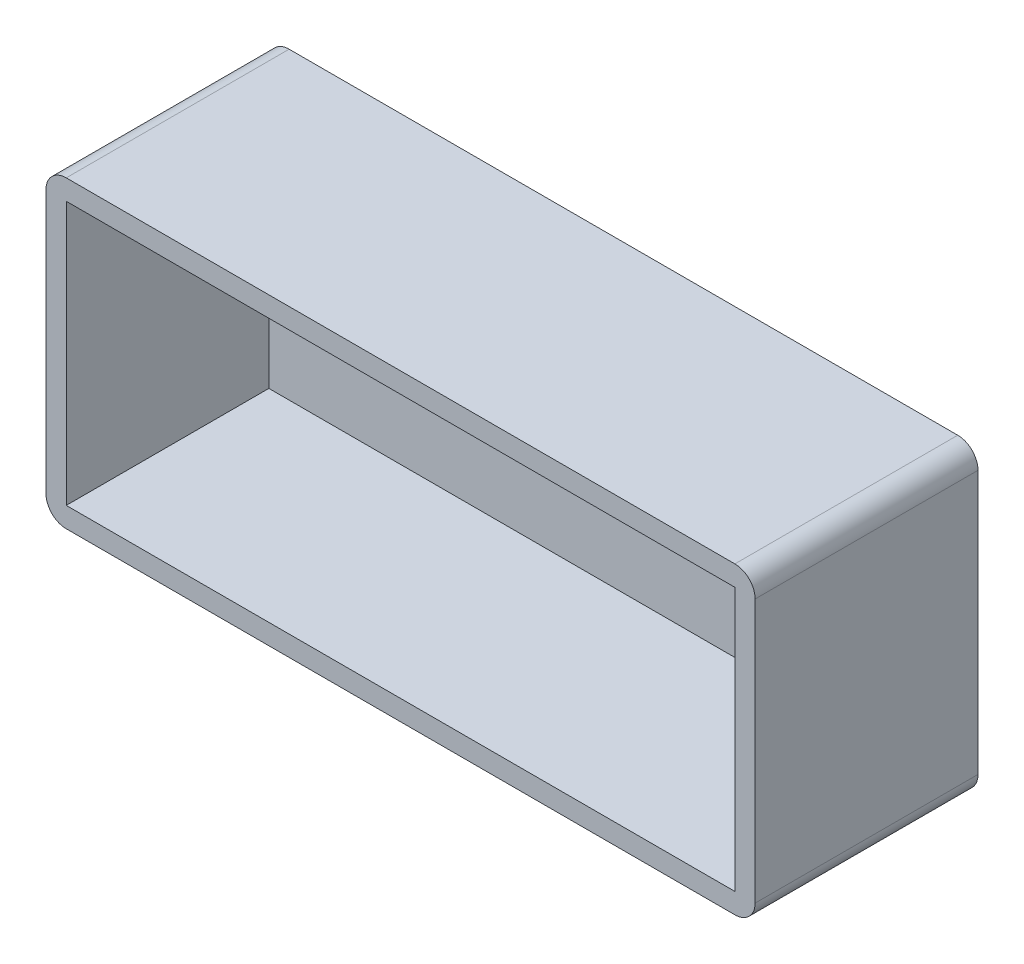
ISO-10303-21;
HEADER;
FILE_DESCRIPTION(('STEP AP214'),'2;1');
FILE_NAME('part.step','',(''),(''),'','','');
FILE_SCHEMA(('AUTOMOTIVE_DESIGN { 1 0 10303 214 1 1 1 1 }'));
ENDSEC;
DATA;
#1=APPLICATION_CONTEXT('core data for automotive mechanical design processes');
#2=APPLICATION_PROTOCOL_DEFINITION('international standard','automotive_design',2000,#1);
#3=PRODUCT_CONTEXT('',#1,'mechanical');
#4=PRODUCT('Part','Part','',(#3));
#5=PRODUCT_RELATED_PRODUCT_CATEGORY('part','',(#4));
#6=PRODUCT_DEFINITION_FORMATION('','',#4);
#7=PRODUCT_DEFINITION_CONTEXT('part definition',#1,'design');
#8=PRODUCT_DEFINITION('design','',#6,#7);
#9=PRODUCT_DEFINITION_SHAPE('','',#8);
#10=(LENGTH_UNIT() NAMED_UNIT(*) SI_UNIT(.MILLI.,.METRE.));
#11=(NAMED_UNIT(*) PLANE_ANGLE_UNIT() SI_UNIT($,.RADIAN.));
#12=(NAMED_UNIT(*) SI_UNIT($,.STERADIAN.) SOLID_ANGLE_UNIT());
#13=UNCERTAINTY_MEASURE_WITH_UNIT(LENGTH_MEASURE(1.E-05),#10,'distance_accuracy_value','');
#14=(GEOMETRIC_REPRESENTATION_CONTEXT(3) GLOBAL_UNCERTAINTY_ASSIGNED_CONTEXT((#13)) GLOBAL_UNIT_ASSIGNED_CONTEXT((#10,
#11,#12)) REPRESENTATION_CONTEXT('',''));
#15=CARTESIAN_POINT('',(0.,0.,0.));
#16=DIRECTION('',(0.,0.,1.));
#17=DIRECTION('',(1.,0.,0.));
#18=AXIS2_PLACEMENT_3D('',#15,#16,#17);
#19=CARTESIAN_POINT('',(2.,28.,22.));
#20=DIRECTION('',(0.,0.,-1.));
#21=DIRECTION('',(-1.,0.,0.));
#22=AXIS2_PLACEMENT_3D('',#19,#20,#21);
#23=CYLINDRICAL_SURFACE('',#22,2.);
#24=DIRECTION('',(0.,0.,-1.));
#25=VECTOR('',#24,1.);
#26=CARTESIAN_POINT('',(0.,28.,22.));
#27=LINE('',#26,#25);
#28=CARTESIAN_POINT('',(0.,28.,22.));
#29=VERTEX_POINT('',#28);
#30=CARTESIAN_POINT('',(0.,28.,0.));
#31=VERTEX_POINT('',#30);
#32=EDGE_CURVE('E388',#29,#31,#27,.T.);
#33=ORIENTED_EDGE('',*,*,#32,.F.);
#34=CARTESIAN_POINT('',(2.,28.,22.));
#35=DIRECTION('',(0.,0.,-1.));
#36=DIRECTION('',(-1.,0.,0.));
#37=AXIS2_PLACEMENT_3D('',#34,#35,#36);
#38=CIRCLE('',#37,2.);
#39=CARTESIAN_POINT('',(2.,30.,22.));
#40=VERTEX_POINT('',#39);
#41=EDGE_CURVE('E47',#40,#29,#38,.F.);
#42=ORIENTED_EDGE('',*,*,#41,.F.);
#43=DIRECTION('',(0.,0.,-1.));
#44=VECTOR('',#43,1.);
#45=CARTESIAN_POINT('',(2.,30.,22.));
#46=LINE('',#45,#44);
#47=CARTESIAN_POINT('',(2.,30.,0.));
#48=VERTEX_POINT('',#47);
#49=EDGE_CURVE('E392',#48,#40,#46,.F.);
#50=ORIENTED_EDGE('',*,*,#49,.F.);
#51=CARTESIAN_POINT('',(2.,28.,0.));
#52=DIRECTION('',(0.,0.,-1.));
#53=DIRECTION('',(-1.,0.,0.));
#54=AXIS2_PLACEMENT_3D('',#51,#52,#53);
#55=CIRCLE('',#54,2.);
#56=EDGE_CURVE('E11',#31,#48,#55,.T.);
#57=ORIENTED_EDGE('',*,*,#56,.F.);
#58=EDGE_LOOP('',(#33,#42,#50,#57));
#59=FACE_BOUND('',#58,.T.);
#60=ADVANCED_FACE('F39',(#59),#23,.T.);
#61=CARTESIAN_POINT('',(2.,2.,22.));
#62=DIRECTION('',(0.,0.,-1.));
#63=DIRECTION('',(-1.,0.,0.));
#64=AXIS2_PLACEMENT_3D('',#61,#62,#63);
#65=CYLINDRICAL_SURFACE('',#64,2.);
#66=DIRECTION('',(0.,0.,-1.));
#67=VECTOR('',#66,1.);
#68=CARTESIAN_POINT('',(2.,0.,22.));
#69=LINE('',#68,#67);
#70=CARTESIAN_POINT('',(2.,0.,22.));
#71=VERTEX_POINT('',#70);
#72=CARTESIAN_POINT('',(2.,0.,0.));
#73=VERTEX_POINT('',#72);
#74=EDGE_CURVE('E373',#71,#73,#69,.T.);
#75=ORIENTED_EDGE('',*,*,#74,.F.);
#76=CARTESIAN_POINT('',(2.,2.,22.));
#77=DIRECTION('',(0.,0.,-1.));
#78=DIRECTION('',(-1.,0.,0.));
#79=AXIS2_PLACEMENT_3D('',#76,#77,#78);
#80=CIRCLE('',#79,2.);
#81=CARTESIAN_POINT('',(0.,2.,22.));
#82=VERTEX_POINT('',#81);
#83=EDGE_CURVE('E381',#82,#71,#80,.F.);
#84=ORIENTED_EDGE('',*,*,#83,.F.);
#85=DIRECTION('',(0.,0.,-1.));
#86=VECTOR('',#85,1.);
#87=CARTESIAN_POINT('',(0.,2.,22.));
#88=LINE('',#87,#86);
#89=CARTESIAN_POINT('',(0.,2.,0.));
#90=VERTEX_POINT('',#89);
#91=EDGE_CURVE('E377',#90,#82,#88,.F.);
#92=ORIENTED_EDGE('',*,*,#91,.F.);
#93=CARTESIAN_POINT('',(2.,2.,0.));
#94=DIRECTION('',(0.,0.,-1.));
#95=DIRECTION('',(-1.,0.,0.));
#96=AXIS2_PLACEMENT_3D('',#93,#94,#95);
#97=CIRCLE('',#96,2.);
#98=EDGE_CURVE('E384',#73,#90,#97,.T.);
#99=ORIENTED_EDGE('',*,*,#98,.F.);
#100=EDGE_LOOP('',(#75,#84,#92,#99));
#101=FACE_BOUND('',#100,.T.);
#102=ADVANCED_FACE('F405',(#101),#65,.T.);
#103=CARTESIAN_POINT('',(68.,28.,22.));
#104=DIRECTION('',(0.,0.,1.));
#105=DIRECTION('',(1.,0.,0.));
#106=AXIS2_PLACEMENT_3D('',#103,#104,#105);
#107=CYLINDRICAL_SURFACE('',#106,2.);
#108=DIRECTION('',(0.,0.,1.));
#109=VECTOR('',#108,1.);
#110=CARTESIAN_POINT('',(70.,28.,22.));
#111=LINE('',#110,#109);
#112=CARTESIAN_POINT('',(70.,28.,0.));
#113=VERTEX_POINT('',#112);
#114=CARTESIAN_POINT('',(70.,28.,22.));
#115=VERTEX_POINT('',#114);
#116=EDGE_CURVE('E359',#113,#115,#111,.T.);
#117=ORIENTED_EDGE('',*,*,#116,.F.);
#118=CARTESIAN_POINT('',(68.,28.,0.));
#119=DIRECTION('',(0.,0.,-1.));
#120=DIRECTION('',(-1.,0.,0.));
#121=AXIS2_PLACEMENT_3D('',#118,#119,#120);
#122=CIRCLE('',#121,2.);
#123=CARTESIAN_POINT('',(68.,30.,0.));
#124=VERTEX_POINT('',#123);
#125=EDGE_CURVE('E367',#124,#113,#122,.T.);
#126=ORIENTED_EDGE('',*,*,#125,.F.);
#127=DIRECTION('',(0.,0.,1.));
#128=VECTOR('',#127,1.);
#129=CARTESIAN_POINT('',(68.,30.,22.));
#130=LINE('',#129,#128);
#131=CARTESIAN_POINT('',(68.,30.,22.));
#132=VERTEX_POINT('',#131);
#133=EDGE_CURVE('E363',#132,#124,#130,.F.);
#134=ORIENTED_EDGE('',*,*,#133,.F.);
#135=CARTESIAN_POINT('',(68.,28.,22.));
#136=DIRECTION('',(0.,0.,-1.));
#137=DIRECTION('',(-1.,0.,0.));
#138=AXIS2_PLACEMENT_3D('',#135,#136,#137);
#139=CIRCLE('',#138,2.);
#140=EDGE_CURVE('E370',#115,#132,#139,.F.);
#141=ORIENTED_EDGE('',*,*,#140,.F.);
#142=EDGE_LOOP('',(#117,#126,#134,#141));
#143=FACE_BOUND('',#142,.T.);
#144=ADVANCED_FACE('F424',(#143),#107,.T.);
#145=CARTESIAN_POINT('',(68.,2.,22.));
#146=DIRECTION('',(0.,0.,1.));
#147=DIRECTION('',(1.,0.,0.));
#148=AXIS2_PLACEMENT_3D('',#145,#146,#147);
#149=CYLINDRICAL_SURFACE('',#148,2.);
#150=DIRECTION('',(0.,0.,1.));
#151=VECTOR('',#150,1.);
#152=CARTESIAN_POINT('',(68.,0.,22.));
#153=LINE('',#152,#151);
#154=CARTESIAN_POINT('',(68.,0.,0.));
#155=VERTEX_POINT('',#154);
#156=CARTESIAN_POINT('',(68.,0.,22.));
#157=VERTEX_POINT('',#156);
#158=EDGE_CURVE('E332',#155,#157,#153,.T.);
#159=ORIENTED_EDGE('',*,*,#158,.F.);
#160=CARTESIAN_POINT('',(68.,2.,0.));
#161=DIRECTION('',(0.,0.,-1.));
#162=DIRECTION('',(-1.,0.,0.));
#163=AXIS2_PLACEMENT_3D('',#160,#161,#162);
#164=CIRCLE('',#163,2.);
#165=CARTESIAN_POINT('',(70.,2.,0.));
#166=VERTEX_POINT('',#165);
#167=EDGE_CURVE('E352',#166,#155,#164,.T.);
#168=ORIENTED_EDGE('',*,*,#167,.F.);
#169=DIRECTION('',(0.,0.,1.));
#170=VECTOR('',#169,1.);
#171=CARTESIAN_POINT('',(70.,2.,22.));
#172=LINE('',#171,#170);
#173=CARTESIAN_POINT('',(70.,2.,22.));
#174=VERTEX_POINT('',#173);
#175=EDGE_CURVE('E348',#174,#166,#172,.F.);
#176=ORIENTED_EDGE('',*,*,#175,.F.);
#177=CARTESIAN_POINT('',(68.,2.,22.));
#178=DIRECTION('',(0.,0.,-1.));
#179=DIRECTION('',(-1.,0.,0.));
#180=AXIS2_PLACEMENT_3D('',#177,#178,#179);
#181=CIRCLE('',#180,2.);
#182=EDGE_CURVE('E356',#157,#174,#181,.F.);
#183=ORIENTED_EDGE('',*,*,#182,.F.);
#184=EDGE_LOOP('',(#159,#168,#176,#183));
#185=FACE_BOUND('',#184,.T.);
#186=ADVANCED_FACE('F412',(#185),#149,.T.);
#187=CARTESIAN_POINT('',(0.,0.,0.));
#188=DIRECTION('',(0.,0.,-1.));
#189=DIRECTION('',(-1.,0.,0.));
#190=AXIS2_PLACEMENT_3D('',#187,#188,#189);
#191=PLANE('',#190);
#192=CARTESIAN_POINT('',(10.,15.,0.));
#193=DIRECTION('',(0.,0.,-1.));
#194=DIRECTION('',(-1.,0.,0.));
#195=AXIS2_PLACEMENT_3D('',#192,#193,#194);
#196=CIRCLE('',#195,2.00000000000001);
#197=CARTESIAN_POINT('',(10.,13.,0.));
#198=VERTEX_POINT('',#197);
#199=CARTESIAN_POINT('',(10.,17.,0.));
#200=VERTEX_POINT('',#199);
#201=EDGE_CURVE('E269',#198,#200,#196,.T.);
#202=ORIENTED_EDGE('',*,*,#201,.F.);
#203=DIRECTION('',(-1.,0.,0.));
#204=VECTOR('',#203,1.);
#205=CARTESIAN_POINT('',(0.,13.,0.));
#206=LINE('',#205,#204);
#207=CARTESIAN_POINT('',(24.,13.,0.));
#208=VERTEX_POINT('',#207);
#209=EDGE_CURVE('E260',#208,#198,#206,.T.);
#210=ORIENTED_EDGE('',*,*,#209,.F.);
#211=CARTESIAN_POINT('',(24.,15.,0.));
#212=DIRECTION('',(0.,0.,-1.));
#213=DIRECTION('',(-1.,0.,0.));
#214=AXIS2_PLACEMENT_3D('',#211,#212,#213);
#215=CIRCLE('',#214,2.00000000000001);
#216=CARTESIAN_POINT('',(24.,17.,0.));
#217=VERTEX_POINT('',#216);
#218=EDGE_CURVE('E182',#217,#208,#215,.T.);
#219=ORIENTED_EDGE('',*,*,#218,.F.);
#220=DIRECTION('',(-1.,0.,0.));
#221=VECTOR('',#220,1.);
#222=CARTESIAN_POINT('',(0.,17.,0.));
#223=LINE('',#222,#221);
#224=EDGE_CURVE('E265',#217,#200,#223,.T.);
#225=ORIENTED_EDGE('',*,*,#224,.T.);
#226=EDGE_LOOP('',(#202,#210,#219,#225));
#227=FACE_BOUND('',#226,.T.);
#228=DIRECTION('',(0.,-1.,0.));
#229=VECTOR('',#228,1.);
#230=CARTESIAN_POINT('',(0.,0.,0.));
#231=LINE('',#230,#229);
#232=EDGE_CURVE('E307',#31,#90,#231,.T.);
#233=ORIENTED_EDGE('',*,*,#232,.F.);
#234=ORIENTED_EDGE('',*,*,#56,.T.);
#235=DIRECTION('',(-1.,0.,0.));
#236=VECTOR('',#235,1.);
#237=CARTESIAN_POINT('',(0.,30.,0.));
#238=LINE('',#237,#236);
#239=EDGE_CURVE('E321',#124,#48,#238,.T.);
#240=ORIENTED_EDGE('',*,*,#239,.F.);
#241=ORIENTED_EDGE('',*,*,#125,.T.);
#242=DIRECTION('',(0.,1.,0.));
#243=VECTOR('',#242,1.);
#244=CARTESIAN_POINT('',(70.,0.,0.));
#245=LINE('',#244,#243);
#246=EDGE_CURVE('E338',#166,#113,#245,.T.);
#247=ORIENTED_EDGE('',*,*,#246,.F.);
#248=ORIENTED_EDGE('',*,*,#167,.T.);
#249=DIRECTION('',(1.,0.,0.));
#250=VECTOR('',#249,1.);
#251=CARTESIAN_POINT('',(0.,0.,0.));
#252=LINE('',#251,#250);
#253=EDGE_CURVE('E335',#73,#155,#252,.T.);
#254=ORIENTED_EDGE('',*,*,#253,.F.);
#255=ORIENTED_EDGE('',*,*,#98,.T.);
#256=EDGE_LOOP('',(#233,#234,#240,#241,#247,#248,#254,#255));
#257=FACE_BOUND('',#256,.T.);
#258=DIRECTION('',(1.,0.,0.));
#259=VECTOR('',#258,1.);
#260=CARTESIAN_POINT('',(0.,13.,0.));
#261=LINE('',#260,#259);
#262=CARTESIAN_POINT('',(46.,13.,0.));
#263=VERTEX_POINT('',#262);
#264=CARTESIAN_POINT('',(60.,13.,0.));
#265=VERTEX_POINT('',#264);
#266=EDGE_CURVE('E252',#263,#265,#261,.T.);
#267=ORIENTED_EDGE('',*,*,#266,.T.);
#268=CARTESIAN_POINT('',(60.,15.,0.));
#269=DIRECTION('',(0.,0.,-1.));
#270=DIRECTION('',(-1.,0.,0.));
#271=AXIS2_PLACEMENT_3D('',#268,#269,#270);
#272=CIRCLE('',#271,2.);
#273=CARTESIAN_POINT('',(60.,17.,0.));
#274=VERTEX_POINT('',#273);
#275=EDGE_CURVE('E256',#265,#274,#272,.F.);
#276=ORIENTED_EDGE('',*,*,#275,.T.);
#277=DIRECTION('',(1.,0.,0.));
#278=VECTOR('',#277,1.);
#279=CARTESIAN_POINT('',(0.,17.,0.));
#280=LINE('',#279,#278);
#281=CARTESIAN_POINT('',(46.,17.,0.));
#282=VERTEX_POINT('',#281);
#283=EDGE_CURVE('E212',#282,#274,#280,.T.);
#284=ORIENTED_EDGE('',*,*,#283,.F.);
#285=CARTESIAN_POINT('',(46.,15.,0.));
#286=DIRECTION('',(0.,0.,-1.));
#287=DIRECTION('',(-1.,0.,0.));
#288=AXIS2_PLACEMENT_3D('',#285,#286,#287);
#289=CIRCLE('',#288,2.);
#290=EDGE_CURVE('E248',#282,#263,#289,.F.);
#291=ORIENTED_EDGE('',*,*,#290,.T.);
#292=EDGE_LOOP('',(#267,#276,#284,#291));
#293=FACE_BOUND('',#292,.T.);
#294=ADVANCED_FACE('F417',(#227,#257,#293),#191,.T.);
#295=CARTESIAN_POINT('',(0.,0.,2.));
#296=DIRECTION('',(0.,0.,1.));
#297=DIRECTION('',(1.,0.,0.));
#298=AXIS2_PLACEMENT_3D('',#295,#296,#297);
#299=PLANE('',#298);
#300=CARTESIAN_POINT('',(10.,15.,2.));
#301=DIRECTION('',(0.,0.,1.));
#302=DIRECTION('',(1.,0.,0.));
#303=AXIS2_PLACEMENT_3D('',#300,#301,#302);
#304=CIRCLE('',#303,2.00000000000001);
#305=CARTESIAN_POINT('',(10.,17.,2.));
#306=VERTEX_POINT('',#305);
#307=CARTESIAN_POINT('',(10.,13.,2.));
#308=VERTEX_POINT('',#307);
#309=EDGE_CURVE('E197',#306,#308,#304,.T.);
#310=ORIENTED_EDGE('',*,*,#309,.F.);
#311=DIRECTION('',(1.,0.,0.));
#312=VECTOR('',#311,1.);
#313=CARTESIAN_POINT('',(10.,17.,2.));
#314=LINE('',#313,#312);
#315=CARTESIAN_POINT('',(24.,17.,2.));
#316=VERTEX_POINT('',#315);
#317=EDGE_CURVE('E202',#306,#316,#314,.T.);
#318=ORIENTED_EDGE('',*,*,#317,.T.);
#319=CARTESIAN_POINT('',(24.,15.,2.));
#320=DIRECTION('',(0.,0.,1.));
#321=DIRECTION('',(1.,0.,0.));
#322=AXIS2_PLACEMENT_3D('',#319,#320,#321);
#323=CIRCLE('',#322,2.00000000000001);
#324=CARTESIAN_POINT('',(24.,13.,2.));
#325=VERTEX_POINT('',#324);
#326=EDGE_CURVE('E179',#325,#316,#323,.T.);
#327=ORIENTED_EDGE('',*,*,#326,.F.);
#328=DIRECTION('',(1.,0.,0.));
#329=VECTOR('',#328,1.);
#330=CARTESIAN_POINT('',(10.,13.,2.));
#331=LINE('',#330,#329);
#332=EDGE_CURVE('E191',#308,#325,#331,.T.);
#333=ORIENTED_EDGE('',*,*,#332,.F.);
#334=EDGE_LOOP('',(#310,#318,#327,#333));
#335=FACE_BOUND('',#334,.T.);
#336=DIRECTION('',(0.,1.,0.));
#337=VECTOR('',#336,1.);
#338=CARTESIAN_POINT('',(68.,28.,2.));
#339=LINE('',#338,#337);
#340=CARTESIAN_POINT('',(68.,2.,2.));
#341=VERTEX_POINT('',#340);
#342=CARTESIAN_POINT('',(68.,28.,2.));
#343=VERTEX_POINT('',#342);
#344=EDGE_CURVE('E273',#341,#343,#339,.T.);
#345=ORIENTED_EDGE('',*,*,#344,.T.);
#346=DIRECTION('',(-1.,0.,0.));
#347=VECTOR('',#346,1.);
#348=CARTESIAN_POINT('',(2.,28.,2.));
#349=LINE('',#348,#347);
#350=CARTESIAN_POINT('',(2.,28.,2.));
#351=VERTEX_POINT('',#350);
#352=EDGE_CURVE('E277',#343,#351,#349,.T.);
#353=ORIENTED_EDGE('',*,*,#352,.T.);
#354=DIRECTION('',(0.,-1.,0.));
#355=VECTOR('',#354,1.);
#356=CARTESIAN_POINT('',(2.,28.,2.));
#357=LINE('',#356,#355);
#358=CARTESIAN_POINT('',(2.,2.,2.));
#359=VERTEX_POINT('',#358);
#360=EDGE_CURVE('E282',#351,#359,#357,.T.);
#361=ORIENTED_EDGE('',*,*,#360,.T.);
#362=DIRECTION('',(1.,0.,0.));
#363=VECTOR('',#362,1.);
#364=CARTESIAN_POINT('',(2.,2.,2.));
#365=LINE('',#364,#363);
#366=EDGE_CURVE('E286',#359,#341,#365,.T.);
#367=ORIENTED_EDGE('',*,*,#366,.T.);
#368=EDGE_LOOP('',(#345,#353,#361,#367));
#369=FACE_BOUND('',#368,.T.);
#370=DIRECTION('',(-1.,0.,0.));
#371=VECTOR('',#370,1.);
#372=CARTESIAN_POINT('',(60.,17.,2.));
#373=LINE('',#372,#371);
#374=CARTESIAN_POINT('',(60.,17.,2.));
#375=VERTEX_POINT('',#374);
#376=CARTESIAN_POINT('',(46.,17.,2.));
#377=VERTEX_POINT('',#376);
#378=EDGE_CURVE('E230',#375,#377,#373,.T.);
#379=ORIENTED_EDGE('',*,*,#378,.F.);
#380=CARTESIAN_POINT('',(60.,15.,2.));
#381=DIRECTION('',(0.,0.,-1.));
#382=DIRECTION('',(-1.,0.,0.));
#383=AXIS2_PLACEMENT_3D('',#380,#381,#382);
#384=CIRCLE('',#383,2.);
#385=CARTESIAN_POINT('',(60.,13.,2.));
#386=VERTEX_POINT('',#385);
#387=EDGE_CURVE('E242',#375,#386,#384,.T.);
#388=ORIENTED_EDGE('',*,*,#387,.T.);
#389=DIRECTION('',(-1.,0.,0.));
#390=VECTOR('',#389,1.);
#391=CARTESIAN_POINT('',(60.,13.,2.));
#392=LINE('',#391,#390);
#393=CARTESIAN_POINT('',(46.,13.,2.));
#394=VERTEX_POINT('',#393);
#395=EDGE_CURVE('E238',#386,#394,#392,.T.);
#396=ORIENTED_EDGE('',*,*,#395,.T.);
#397=CARTESIAN_POINT('',(46.,15.,2.));
#398=DIRECTION('',(0.,0.,-1.));
#399=DIRECTION('',(-1.,0.,0.));
#400=AXIS2_PLACEMENT_3D('',#397,#398,#399);
#401=CIRCLE('',#400,2.);
#402=EDGE_CURVE('E234',#394,#377,#401,.T.);
#403=ORIENTED_EDGE('',*,*,#402,.T.);
#404=EDGE_LOOP('',(#379,#388,#396,#403));
#405=FACE_BOUND('',#404,.T.);
#406=ADVANCED_FACE('F199',(#335,#369,#405),#299,.T.);
#407=CARTESIAN_POINT('',(0.,0.,22.));
#408=DIRECTION('',(1.,0.,0.));
#409=DIRECTION('',(0.,0.,-1.));
#410=AXIS2_PLACEMENT_3D('',#407,#408,#409);
#411=PLANE('',#410);
#412=DIRECTION('',(0.,-1.,0.));
#413=VECTOR('',#412,1.);
#414=CARTESIAN_POINT('',(0.,0.,22.));
#415=LINE('',#414,#413);
#416=EDGE_CURVE('E317',#29,#82,#415,.T.);
#417=ORIENTED_EDGE('',*,*,#416,.F.);
#418=ORIENTED_EDGE('',*,*,#32,.T.);
#419=ORIENTED_EDGE('',*,*,#232,.T.);
#420=ORIENTED_EDGE('',*,*,#91,.T.);
#421=EDGE_LOOP('',(#417,#418,#419,#420));
#422=FACE_BOUND('',#421,.T.);
#423=ADVANCED_FACE('F401',(#422),#411,.F.);
#424=CARTESIAN_POINT('',(0.,0.,22.));
#425=DIRECTION('',(0.,1.,0.));
#426=DIRECTION('',(0.,0.,1.));
#427=AXIS2_PLACEMENT_3D('',#424,#425,#426);
#428=PLANE('',#427);
#429=DIRECTION('',(1.,0.,0.));
#430=VECTOR('',#429,1.);
#431=CARTESIAN_POINT('',(0.,0.,22.));
#432=LINE('',#431,#430);
#433=EDGE_CURVE('E320',#71,#157,#432,.T.);
#434=ORIENTED_EDGE('',*,*,#433,.F.);
#435=ORIENTED_EDGE('',*,*,#74,.T.);
#436=ORIENTED_EDGE('',*,*,#253,.T.);
#437=ORIENTED_EDGE('',*,*,#158,.T.);
#438=EDGE_LOOP('',(#434,#435,#436,#437));
#439=FACE_BOUND('',#438,.T.);
#440=ADVANCED_FACE('F414',(#439),#428,.F.);
#441=CARTESIAN_POINT('',(70.,0.,22.));
#442=DIRECTION('',(-1.,0.,0.));
#443=DIRECTION('',(0.,0.,1.));
#444=AXIS2_PLACEMENT_3D('',#441,#442,#443);
#445=PLANE('',#444);
#446=ORIENTED_EDGE('',*,*,#246,.T.);
#447=ORIENTED_EDGE('',*,*,#116,.T.);
#448=DIRECTION('',(0.,1.,0.));
#449=VECTOR('',#448,1.);
#450=CARTESIAN_POINT('',(70.,0.,22.));
#451=LINE('',#450,#449);
#452=EDGE_CURVE('E324',#174,#115,#451,.T.);
#453=ORIENTED_EDGE('',*,*,#452,.F.);
#454=ORIENTED_EDGE('',*,*,#175,.T.);
#455=EDGE_LOOP('',(#446,#447,#453,#454));
#456=FACE_BOUND('',#455,.T.);
#457=ADVANCED_FACE('F420',(#456),#445,.F.);
#458=CARTESIAN_POINT('',(0.,30.,22.));
#459=DIRECTION('',(0.,-1.,0.));
#460=DIRECTION('',(0.,0.,-1.));
#461=AXIS2_PLACEMENT_3D('',#458,#459,#460);
#462=PLANE('',#461);
#463=ORIENTED_EDGE('',*,*,#239,.T.);
#464=ORIENTED_EDGE('',*,*,#49,.T.);
#465=DIRECTION('',(-1.,0.,0.));
#466=VECTOR('',#465,1.);
#467=CARTESIAN_POINT('',(0.,30.,22.));
#468=LINE('',#467,#466);
#469=EDGE_CURVE('E328',#132,#40,#468,.T.);
#470=ORIENTED_EDGE('',*,*,#469,.F.);
#471=ORIENTED_EDGE('',*,*,#133,.T.);
#472=EDGE_LOOP('',(#463,#464,#470,#471));
#473=FACE_BOUND('',#472,.T.);
#474=ADVANCED_FACE('F426',(#473),#462,.F.);
#475=CARTESIAN_POINT('',(0.,0.,22.));
#476=DIRECTION('',(0.,0.,-1.));
#477=DIRECTION('',(-1.,0.,0.));
#478=AXIS2_PLACEMENT_3D('',#475,#476,#477);
#479=PLANE('',#478);
#480=DIRECTION('',(-1.,0.,0.));
#481=VECTOR('',#480,1.);
#482=CARTESIAN_POINT('',(2.,28.,22.));
#483=LINE('',#482,#481);
#484=CARTESIAN_POINT('',(68.,28.,22.));
#485=VERTEX_POINT('',#484);
#486=CARTESIAN_POINT('',(2.,28.,22.));
#487=VERTEX_POINT('',#486);
#488=EDGE_CURVE('E293',#485,#487,#483,.T.);
#489=ORIENTED_EDGE('',*,*,#488,.F.);
#490=DIRECTION('',(0.,1.,0.));
#491=VECTOR('',#490,1.);
#492=CARTESIAN_POINT('',(68.,28.,22.));
#493=LINE('',#492,#491);
#494=CARTESIAN_POINT('',(68.,2.,22.));
#495=VERTEX_POINT('',#494);
#496=EDGE_CURVE('E272',#495,#485,#493,.T.);
#497=ORIENTED_EDGE('',*,*,#496,.F.);
#498=DIRECTION('',(1.,0.,0.));
#499=VECTOR('',#498,1.);
#500=CARTESIAN_POINT('',(2.,2.,22.));
#501=LINE('',#500,#499);
#502=CARTESIAN_POINT('',(2.,2.,22.));
#503=VERTEX_POINT('',#502);
#504=EDGE_CURVE('E278',#503,#495,#501,.T.);
#505=ORIENTED_EDGE('',*,*,#504,.F.);
#506=DIRECTION('',(0.,-1.,0.));
#507=VECTOR('',#506,1.);
#508=CARTESIAN_POINT('',(2.,28.,22.));
#509=LINE('',#508,#507);
#510=EDGE_CURVE('E297',#487,#503,#509,.T.);
#511=ORIENTED_EDGE('',*,*,#510,.F.);
#512=EDGE_LOOP('',(#489,#497,#505,#511));
#513=FACE_BOUND('',#512,.T.);
#514=ORIENTED_EDGE('',*,*,#469,.T.);
#515=ORIENTED_EDGE('',*,*,#41,.T.);
#516=ORIENTED_EDGE('',*,*,#416,.T.);
#517=ORIENTED_EDGE('',*,*,#83,.T.);
#518=ORIENTED_EDGE('',*,*,#433,.T.);
#519=ORIENTED_EDGE('',*,*,#182,.T.);
#520=ORIENTED_EDGE('',*,*,#452,.T.);
#521=ORIENTED_EDGE('',*,*,#140,.T.);
#522=EDGE_LOOP('',(#514,#515,#516,#517,#518,#519,#520,#521));
#523=FACE_BOUND('',#522,.T.);
#524=ADVANCED_FACE('F396',(#513,#523),#479,.F.);
#525=CARTESIAN_POINT('',(68.,28.,2.));
#526=DIRECTION('',(1.,0.,0.));
#527=DIRECTION('',(0.,0.,-1.));
#528=AXIS2_PLACEMENT_3D('',#525,#526,#527);
#529=PLANE('',#528);
#530=ORIENTED_EDGE('',*,*,#496,.T.);
#531=DIRECTION('',(0.,0.,1.));
#532=VECTOR('',#531,1.);
#533=CARTESIAN_POINT('',(68.,28.,2.));
#534=LINE('',#533,#532);
#535=EDGE_CURVE('E290',#343,#485,#534,.T.);
#536=ORIENTED_EDGE('',*,*,#535,.F.);
#537=ORIENTED_EDGE('',*,*,#344,.F.);
#538=DIRECTION('',(0.,0.,1.));
#539=VECTOR('',#538,1.);
#540=CARTESIAN_POINT('',(68.,2.,2.));
#541=LINE('',#540,#539);
#542=EDGE_CURVE('E304',#341,#495,#541,.T.);
#543=ORIENTED_EDGE('',*,*,#542,.T.);
#544=EDGE_LOOP('',(#530,#536,#537,#543));
#545=FACE_BOUND('',#544,.T.);
#546=ADVANCED_FACE('F433',(#545),#529,.F.);
#547=CARTESIAN_POINT('',(2.,2.,2.));
#548=DIRECTION('',(0.,-1.,0.));
#549=DIRECTION('',(0.,0.,-1.));
#550=AXIS2_PLACEMENT_3D('',#547,#548,#549);
#551=PLANE('',#550);
#552=ORIENTED_EDGE('',*,*,#504,.T.);
#553=ORIENTED_EDGE('',*,*,#542,.F.);
#554=ORIENTED_EDGE('',*,*,#366,.F.);
#555=DIRECTION('',(0.,0.,1.));
#556=VECTOR('',#555,1.);
#557=CARTESIAN_POINT('',(2.,2.,2.));
#558=LINE('',#557,#556);
#559=EDGE_CURVE('E308',#359,#503,#558,.T.);
#560=ORIENTED_EDGE('',*,*,#559,.T.);
#561=EDGE_LOOP('',(#552,#553,#554,#560));
#562=FACE_BOUND('',#561,.T.);
#563=ADVANCED_FACE('F597',(#562),#551,.F.);
#564=CARTESIAN_POINT('',(2.,28.,2.));
#565=DIRECTION('',(-1.,0.,0.));
#566=DIRECTION('',(0.,-1.,0.));
#567=AXIS2_PLACEMENT_3D('',#564,#565,#566);
#568=PLANE('',#567);
#569=ORIENTED_EDGE('',*,*,#510,.T.);
#570=ORIENTED_EDGE('',*,*,#559,.F.);
#571=ORIENTED_EDGE('',*,*,#360,.F.);
#572=DIRECTION('',(0.,0.,1.));
#573=VECTOR('',#572,1.);
#574=CARTESIAN_POINT('',(2.,28.,2.));
#575=LINE('',#574,#573);
#576=EDGE_CURVE('E311',#351,#487,#575,.T.);
#577=ORIENTED_EDGE('',*,*,#576,.T.);
#578=EDGE_LOOP('',(#569,#570,#571,#577));
#579=FACE_BOUND('',#578,.T.);
#580=ADVANCED_FACE('F604',(#579),#568,.F.);
#581=CARTESIAN_POINT('',(2.,28.,2.));
#582=DIRECTION('',(0.,1.,0.));
#583=DIRECTION('',(0.,0.,1.));
#584=AXIS2_PLACEMENT_3D('',#581,#582,#583);
#585=PLANE('',#584);
#586=ORIENTED_EDGE('',*,*,#488,.T.);
#587=ORIENTED_EDGE('',*,*,#576,.F.);
#588=ORIENTED_EDGE('',*,*,#352,.F.);
#589=ORIENTED_EDGE('',*,*,#535,.T.);
#590=EDGE_LOOP('',(#586,#587,#588,#589));
#591=FACE_BOUND('',#590,.T.);
#592=ADVANCED_FACE('F487',(#591),#585,.F.);
#593=CARTESIAN_POINT('',(60.,15.,-18.));
#594=DIRECTION('',(0.,0.,1.));
#595=DIRECTION('',(1.,0.,0.));
#596=AXIS2_PLACEMENT_3D('',#593,#594,#595);
#597=CYLINDRICAL_SURFACE('',#596,2.);
#598=DIRECTION('',(0.,0.,1.));
#599=VECTOR('',#598,1.);
#600=CARTESIAN_POINT('',(60.,13.,-18.));
#601=LINE('',#600,#599);
#602=EDGE_CURVE('E217',#265,#386,#601,.T.);
#603=ORIENTED_EDGE('',*,*,#602,.T.);
#604=ORIENTED_EDGE('',*,*,#387,.F.);
#605=DIRECTION('',(0.,0.,1.));
#606=VECTOR('',#605,1.);
#607=CARTESIAN_POINT('',(60.,17.,-18.));
#608=LINE('',#607,#606);
#609=EDGE_CURVE('E226',#274,#375,#608,.T.);
#610=ORIENTED_EDGE('',*,*,#609,.F.);
#611=ORIENTED_EDGE('',*,*,#275,.F.);
#612=EDGE_LOOP('',(#603,#604,#610,#611));
#613=FACE_BOUND('',#612,.T.);
#614=ADVANCED_FACE('F491',(#613),#597,.F.);
#615=CARTESIAN_POINT('',(60.,13.,-18.));
#616=DIRECTION('',(0.,1.,0.));
#617=DIRECTION('',(0.,0.,1.));
#618=AXIS2_PLACEMENT_3D('',#615,#616,#617);
#619=PLANE('',#618);
#620=DIRECTION('',(0.,0.,1.));
#621=VECTOR('',#620,1.);
#622=CARTESIAN_POINT('',(46.,13.,-18.));
#623=LINE('',#622,#621);
#624=EDGE_CURVE('E220',#263,#394,#623,.T.);
#625=ORIENTED_EDGE('',*,*,#624,.T.);
#626=ORIENTED_EDGE('',*,*,#395,.F.);
#627=ORIENTED_EDGE('',*,*,#602,.F.);
#628=ORIENTED_EDGE('',*,*,#266,.F.);
#629=EDGE_LOOP('',(#625,#626,#627,#628));
#630=FACE_BOUND('',#629,.T.);
#631=ADVANCED_FACE('F496',(#630),#619,.T.);
#632=CARTESIAN_POINT('',(46.,15.,-18.));
#633=DIRECTION('',(0.,0.,1.));
#634=DIRECTION('',(1.,0.,0.));
#635=AXIS2_PLACEMENT_3D('',#632,#633,#634);
#636=CYLINDRICAL_SURFACE('',#635,2.);
#637=DIRECTION('',(0.,0.,1.));
#638=VECTOR('',#637,1.);
#639=CARTESIAN_POINT('',(46.,17.,-18.));
#640=LINE('',#639,#638);
#641=EDGE_CURVE('E223',#282,#377,#640,.T.);
#642=ORIENTED_EDGE('',*,*,#641,.T.);
#643=ORIENTED_EDGE('',*,*,#402,.F.);
#644=ORIENTED_EDGE('',*,*,#624,.F.);
#645=ORIENTED_EDGE('',*,*,#290,.F.);
#646=EDGE_LOOP('',(#642,#643,#644,#645));
#647=FACE_BOUND('',#646,.T.);
#648=ADVANCED_FACE('F506',(#647),#636,.F.);
#649=CARTESIAN_POINT('',(60.,17.,-18.));
#650=DIRECTION('',(0.,1.,0.));
#651=DIRECTION('',(0.,0.,1.));
#652=AXIS2_PLACEMENT_3D('',#649,#650,#651);
#653=PLANE('',#652);
#654=ORIENTED_EDGE('',*,*,#283,.T.);
#655=ORIENTED_EDGE('',*,*,#609,.T.);
#656=ORIENTED_EDGE('',*,*,#378,.T.);
#657=ORIENTED_EDGE('',*,*,#641,.F.);
#658=EDGE_LOOP('',(#654,#655,#656,#657));
#659=FACE_BOUND('',#658,.T.);
#660=ADVANCED_FACE('F516',(#659),#653,.F.);
#661=CARTESIAN_POINT('',(10.,15.,-18.));
#662=DIRECTION('',(0.,0.,1.));
#663=DIRECTION('',(1.,0.,0.));
#664=AXIS2_PLACEMENT_3D('',#661,#662,#663);
#665=CYLINDRICAL_SURFACE('',#664,2.00000000000001);
#666=ORIENTED_EDGE('',*,*,#201,.T.);
#667=DIRECTION('',(0.,0.,1.));
#668=VECTOR('',#667,1.);
#669=CARTESIAN_POINT('',(10.,17.,-18.));
#670=LINE('',#669,#668);
#671=EDGE_CURVE('E209',#200,#306,#670,.T.);
#672=ORIENTED_EDGE('',*,*,#671,.T.);
#673=ORIENTED_EDGE('',*,*,#309,.T.);
#674=DIRECTION('',(0.,0.,1.));
#675=VECTOR('',#674,1.);
#676=CARTESIAN_POINT('',(10.,13.,-18.));
#677=LINE('',#676,#675);
#678=EDGE_CURVE('E187',#198,#308,#677,.T.);
#679=ORIENTED_EDGE('',*,*,#678,.F.);
#680=EDGE_LOOP('',(#666,#672,#673,#679));
#681=FACE_BOUND('',#680,.T.);
#682=ADVANCED_FACE('F526',(#681),#665,.F.);
#683=CARTESIAN_POINT('',(10.,17.,-18.));
#684=DIRECTION('',(0.,-1.,0.));
#685=DIRECTION('',(0.,0.,-1.));
#686=AXIS2_PLACEMENT_3D('',#683,#684,#685);
#687=PLANE('',#686);
#688=DIRECTION('',(0.,0.,1.));
#689=VECTOR('',#688,1.);
#690=CARTESIAN_POINT('',(24.,17.,-18.));
#691=LINE('',#690,#689);
#692=EDGE_CURVE('E186',#217,#316,#691,.T.);
#693=ORIENTED_EDGE('',*,*,#692,.T.);
#694=ORIENTED_EDGE('',*,*,#317,.F.);
#695=ORIENTED_EDGE('',*,*,#671,.F.);
#696=ORIENTED_EDGE('',*,*,#224,.F.);
#697=EDGE_LOOP('',(#693,#694,#695,#696));
#698=FACE_BOUND('',#697,.T.);
#699=ADVANCED_FACE('F536',(#698),#687,.T.);
#700=CARTESIAN_POINT('',(24.,15.,-18.));
#701=DIRECTION('',(0.,0.,1.));
#702=DIRECTION('',(1.,0.,0.));
#703=AXIS2_PLACEMENT_3D('',#700,#701,#702);
#704=CYLINDRICAL_SURFACE('',#703,2.00000000000001);
#705=ORIENTED_EDGE('',*,*,#218,.T.);
#706=DIRECTION('',(0.,0.,1.));
#707=VECTOR('',#706,1.);
#708=CARTESIAN_POINT('',(24.,13.,-18.));
#709=LINE('',#708,#707);
#710=EDGE_CURVE('E174',#208,#325,#709,.T.);
#711=ORIENTED_EDGE('',*,*,#710,.T.);
#712=ORIENTED_EDGE('',*,*,#326,.T.);
#713=ORIENTED_EDGE('',*,*,#692,.F.);
#714=EDGE_LOOP('',(#705,#711,#712,#713));
#715=FACE_BOUND('',#714,.T.);
#716=ADVANCED_FACE('F176',(#715),#704,.F.);
#717=CARTESIAN_POINT('',(10.,13.,-18.));
#718=DIRECTION('',(0.,-1.,0.));
#719=DIRECTION('',(0.,0.,-1.));
#720=AXIS2_PLACEMENT_3D('',#717,#718,#719);
#721=PLANE('',#720);
#722=ORIENTED_EDGE('',*,*,#209,.T.);
#723=ORIENTED_EDGE('',*,*,#678,.T.);
#724=ORIENTED_EDGE('',*,*,#332,.T.);
#725=ORIENTED_EDGE('',*,*,#710,.F.);
#726=EDGE_LOOP('',(#722,#723,#724,#725));
#727=FACE_BOUND('',#726,.T.);
#728=ADVANCED_FACE('F192',(#727),#721,.F.);
#729=CLOSED_SHELL('',(#60,#102,#144,#186,#294,#406,#423,#440,#457,#474,#524,#546,#563,#580,#592,
#614,#631,#648,#660,#682,#699,#716,#728));
#730=MANIFOLD_SOLID_BREP('B2',#729);
#731=ADVANCED_BREP_SHAPE_REPRESENTATION('',(#18,#730),#14);
#732=SHAPE_DEFINITION_REPRESENTATION(#9,#731);
ENDSEC;
END-ISO-10303-21;
